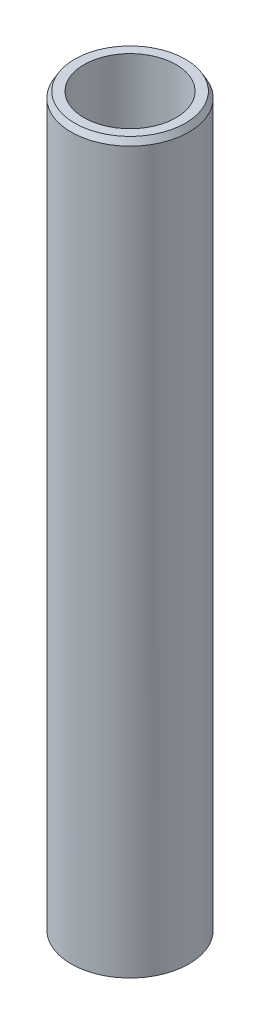
ISO-10303-21;
HEADER;
FILE_DESCRIPTION(('STEP AP214'),'2;1');
FILE_NAME('part.step','',(''),(''),'','','');
FILE_SCHEMA(('AUTOMOTIVE_DESIGN { 1 0 10303 214 1 1 1 1 }'));
ENDSEC;
DATA;
#1=APPLICATION_CONTEXT('core data for automotive mechanical design processes');
#2=APPLICATION_PROTOCOL_DEFINITION('international standard','automotive_design',2000,#1);
#3=PRODUCT_CONTEXT('',#1,'mechanical');
#4=PRODUCT('Part','Part','',(#3));
#5=PRODUCT_RELATED_PRODUCT_CATEGORY('part','',(#4));
#6=PRODUCT_DEFINITION_FORMATION('','',#4);
#7=PRODUCT_DEFINITION_CONTEXT('part definition',#1,'design');
#8=PRODUCT_DEFINITION('design','',#6,#7);
#9=PRODUCT_DEFINITION_SHAPE('','',#8);
#10=(LENGTH_UNIT() NAMED_UNIT(*) SI_UNIT(.MILLI.,.METRE.));
#11=(NAMED_UNIT(*) PLANE_ANGLE_UNIT() SI_UNIT($,.RADIAN.));
#12=(NAMED_UNIT(*) SI_UNIT($,.STERADIAN.) SOLID_ANGLE_UNIT());
#13=UNCERTAINTY_MEASURE_WITH_UNIT(LENGTH_MEASURE(1.E-05),#10,'distance_accuracy_value','');
#14=(GEOMETRIC_REPRESENTATION_CONTEXT(3) GLOBAL_UNCERTAINTY_ASSIGNED_CONTEXT((#13)) GLOBAL_UNIT_ASSIGNED_CONTEXT((#10,
#11,#12)) REPRESENTATION_CONTEXT('',''));
#15=CARTESIAN_POINT('',(0.,0.,0.));
#16=DIRECTION('',(0.,0.,1.));
#17=DIRECTION('',(1.,0.,0.));
#18=AXIS2_PLACEMENT_3D('',#15,#16,#17);
#19=CARTESIAN_POINT('',(0.,495.857883520627,0.));
#20=DIRECTION('',(0.,-1.,0.));
#21=DIRECTION('',(0.,0.,-1.));
#22=AXIS2_PLACEMENT_3D('',#19,#20,#21);
#23=CYLINDRICAL_SURFACE('',#22,40.);
#24=CARTESIAN_POINT('',(0.,491.773946002479,0.));
#25=DIRECTION('',(0.,1.,0.));
#26=DIRECTION('',(0.,0.,1.));
#27=AXIS2_PLACEMENT_3D('',#24,#25,#26);
#28=CIRCLE('',#27,40.);
#29=CARTESIAN_POINT('',(0.,491.773946002479,-40.));
#30=VERTEX_POINT('',#29);
#31=EDGE_CURVE('E50',#30,#30,#28,.F.);
#32=CARTESIAN_POINT('',(0.,2.35786242545671,0.));
#33=DIRECTION('',(0.,1.,0.));
#34=DIRECTION('',(0.,0.,1.));
#35=AXIS2_PLACEMENT_3D('',#32,#33,#34);
#36=CIRCLE('',#35,40.);
#37=CARTESIAN_POINT('',(0.,2.35786242545666,-40.));
#38=VERTEX_POINT('',#37);
#39=EDGE_CURVE('E51',#38,#38,#36,.T.);
#40=CARTESIAN_POINT('',(0.,491.773946002479,-40.));
#41=CARTESIAN_POINT('',(0.,486.675861798551,-40.));
#42=CARTESIAN_POINT('',(0.,481.577777594624,-40.));
#43=CARTESIAN_POINT('',(0.,471.381609186769,-40.));
#44=CARTESIAN_POINT('',(0.,466.283524982842,-40.));
#45=CARTESIAN_POINT('',(0.,456.087356574987,-40.));
#46=CARTESIAN_POINT('',(0.,450.98927237106,-40.));
#47=CARTESIAN_POINT('',(0.,440.793103963205,-40.));
#48=CARTESIAN_POINT('',(0.,435.695019759278,-40.));
#49=CARTESIAN_POINT('',(0.,425.498851351424,-40.));
#50=CARTESIAN_POINT('',(0.,420.400767147496,-40.));
#51=CARTESIAN_POINT('',(0.,410.204598739642,-40.));
#52=CARTESIAN_POINT('',(0.,405.106514535714,-40.));
#53=CARTESIAN_POINT('',(0.,394.91034612786,-40.));
#54=CARTESIAN_POINT('',(0.,389.812261923932,-40.));
#55=CARTESIAN_POINT('',(0.,379.616093516078,-40.));
#56=CARTESIAN_POINT('',(0.,374.51800931215,-40.));
#57=CARTESIAN_POINT('',(0.,364.321840904296,-40.));
#58=CARTESIAN_POINT('',(0.,359.223756700369,-40.));
#59=CARTESIAN_POINT('',(0.,349.027588292514,-40.));
#60=CARTESIAN_POINT('',(0.,343.929504088587,-40.));
#61=CARTESIAN_POINT('',(0.,333.733335680732,-40.));
#62=CARTESIAN_POINT('',(0.,328.635251476805,-40.));
#63=CARTESIAN_POINT('',(0.,318.43908306895,-40.));
#64=CARTESIAN_POINT('',(0.,313.340998865023,-40.));
#65=CARTESIAN_POINT('',(0.,303.144830457168,-40.));
#66=CARTESIAN_POINT('',(0.,298.046746253241,-40.));
#67=CARTESIAN_POINT('',(0.,287.850577845386,-40.));
#68=CARTESIAN_POINT('',(0.,282.752493641459,-40.));
#69=CARTESIAN_POINT('',(0.,272.556325233604,-40.));
#70=CARTESIAN_POINT('',(0.,267.458241029677,-40.));
#71=CARTESIAN_POINT('',(0.,257.262072621822,-40.));
#72=CARTESIAN_POINT('',(0.,252.163988417895,-40.));
#73=CARTESIAN_POINT('',(0.,241.96782001004,-40.));
#74=CARTESIAN_POINT('',(0.,236.869735806113,-40.));
#75=CARTESIAN_POINT('',(0.,226.673567398258,-40.));
#76=CARTESIAN_POINT('',(0.,221.575483194331,-40.));
#77=CARTESIAN_POINT('',(0.,211.379314786476,-40.));
#78=CARTESIAN_POINT('',(0.,206.281230582549,-40.));
#79=CARTESIAN_POINT('',(0.,196.085062174695,-40.));
#80=CARTESIAN_POINT('',(0.,190.986977970767,-40.));
#81=CARTESIAN_POINT('',(0.,180.790809562913,-40.));
#82=CARTESIAN_POINT('',(0.,175.692725358985,-40.));
#83=CARTESIAN_POINT('',(0.,165.496556951131,-40.));
#84=CARTESIAN_POINT('',(0.,160.398472747203,-40.));
#85=CARTESIAN_POINT('',(0.,150.202304339349,-40.));
#86=CARTESIAN_POINT('',(0.,145.104220135421,-40.));
#87=CARTESIAN_POINT('',(0.,134.908051727567,-40.));
#88=CARTESIAN_POINT('',(0.,129.80996752364,-40.));
#89=CARTESIAN_POINT('',(0.,119.613799115785,-40.));
#90=CARTESIAN_POINT('',(0.,114.515714911858,-40.));
#91=CARTESIAN_POINT('',(0.,104.319546504003,-40.));
#92=CARTESIAN_POINT('',(0.,99.2214623000756,-40.));
#93=CARTESIAN_POINT('',(0.,89.025293892221,-40.));
#94=CARTESIAN_POINT('',(0.,83.9272096882937,-40.));
#95=CARTESIAN_POINT('',(0.,73.7310412804391,-40.));
#96=CARTESIAN_POINT('',(0.,68.6329570765117,-40.));
#97=CARTESIAN_POINT('',(0.,58.4367886686571,-40.));
#98=CARTESIAN_POINT('',(0.,53.3387044647298,-40.));
#99=CARTESIAN_POINT('',(0.,43.1425360568751,-40.));
#100=CARTESIAN_POINT('',(0.,38.0444518529478,-40.));
#101=CARTESIAN_POINT('',(0.,27.8482834450932,-40.));
#102=CARTESIAN_POINT('',(0.,22.7501992411659,-40.));
#103=CARTESIAN_POINT('',(0.,12.5540308333113,-40.));
#104=CARTESIAN_POINT('',(0.,7.45594662938398,-40.));
#105=CARTESIAN_POINT('',(0.,2.35786242545666,-40.));
#106=B_SPLINE_CURVE_WITH_KNOTS('',3,(#40,#41,#42,#43,#44,#45,#46,#47,#48,#49,#50,#51,#52,#53,
#54,#55,#56,#57,#58,#59,#60,#61,#62,#63,#64,#65,#66,#67,#68,#69,#70,#71,#72,#73,#74,#75,#76,#77,
#78,#79,#80,#81,#82,#83,#84,#85,#86,#87,#88,#89,#90,#91,#92,#93,#94,#95,#96,#97,#98,#99,#100,
#101,#102,#103,#104,#105),.UNSPECIFIED.,.F.,.F.,(4,2,2,2,2,2,2,2,2,2,2,2,2,2,2,2,2,2,2,2,2,2,2,
2,2,2,2,2,2,2,2,2,4),(0.,15.294252611782,30.5885052235639,45.8827578353458,61.1770104471278,
76.4712630589097,91.7655156706916,107.059768282474,122.354020894256,137.648273506037,
152.942526117819,168.236778729601,183.531031341383,198.825283953165,214.119536564947,
229.413789176729,244.708041788511,260.002294400293,275.296547012075,290.590799623857,
305.885052235639,321.179304847421,336.473557459203,351.767810070985,367.062062682766,
382.356315294548,397.65056790633,412.944820518112,428.239073129894,443.533325741676,
458.827578353458,474.12183096524,489.416083577022),.UNSPECIFIED.);
#107=EDGE_CURVE('BSEAM39',#30,#38,#106,.T.);
#108=ORIENTED_EDGE('',*,*,#31,.T.);
#109=ORIENTED_EDGE('',*,*,#39,.T.);
#110=ORIENTED_EDGE('',*,*,#107,.T.);
#111=ORIENTED_EDGE('',*,*,#107,.F.);
#112=EDGE_LOOP('',(#108,#110,#109,#111));
#113=FACE_BOUND('',#112,.T.);
#114=ADVANCED_FACE('F39',(#113),#23,.T.);
#115=CARTESIAN_POINT('',(0.,495.857883520627,0.));
#116=DIRECTION('',(0.,1.,0.));
#117=DIRECTION('',(0.,0.,1.));
#118=AXIS2_PLACEMENT_3D('',#115,#116,#117);
#119=PLANE('',#118);
#120=CARTESIAN_POINT('',(0.,495.857883520627,0.));
#121=DIRECTION('',(0.,1.,0.));
#122=DIRECTION('',(0.,0.,1.));
#123=AXIS2_PLACEMENT_3D('',#120,#121,#122);
#124=CIRCLE('',#123,37.6421375745438);
#125=CARTESIAN_POINT('',(0.,495.857883520627,37.6421375745438));
#126=VERTEX_POINT('',#125);
#127=EDGE_CURVE('E54',#126,#126,#124,.T.);
#128=ORIENTED_EDGE('',*,*,#127,.T.);
#129=EDGE_LOOP('',(#128));
#130=FACE_BOUND('',#129,.T.);
#131=CARTESIAN_POINT('',(0.,495.857883520627,0.));
#132=DIRECTION('',(0.,1.,0.));
#133=DIRECTION('',(0.,0.,1.));
#134=AXIS2_PLACEMENT_3D('',#131,#132,#133);
#135=CIRCLE('',#134,31.2653921572094);
#136=CARTESIAN_POINT('',(0.,495.857883520627,-31.2653921572094));
#137=VERTEX_POINT('',#136);
#138=EDGE_CURVE('E58',#137,#137,#135,.T.);
#139=ORIENTED_EDGE('',*,*,#138,.F.);
#140=EDGE_LOOP('',(#139));
#141=FACE_BOUND('',#140,.T.);
#142=ADVANCED_FACE('F69',(#130,#141),#119,.T.);
#143=CARTESIAN_POINT('',(0.,0.,0.));
#144=DIRECTION('',(0.,1.,0.));
#145=DIRECTION('',(0.,0.,1.));
#146=AXIS2_PLACEMENT_3D('',#143,#144,#145);
#147=PLANE('',#146);
#148=CARTESIAN_POINT('',(0.,0.,0.));
#149=DIRECTION('',(0.,1.,0.));
#150=DIRECTION('',(0.,0.,1.));
#151=AXIS2_PLACEMENT_3D('',#148,#149,#150);
#152=CIRCLE('',#151,35.9160624818514);
#153=CARTESIAN_POINT('',(0.,0.,35.9160624818514));
#154=VERTEX_POINT('',#153);
#155=EDGE_CURVE('E10',#154,#154,#152,.F.);
#156=ORIENTED_EDGE('',*,*,#155,.T.);
#157=EDGE_LOOP('',(#156));
#158=FACE_BOUND('',#157,.T.);
#159=CARTESIAN_POINT('',(0.,0.,0.));
#160=DIRECTION('',(0.,1.,0.));
#161=DIRECTION('',(0.,0.,1.));
#162=AXIS2_PLACEMENT_3D('',#159,#160,#161);
#163=CIRCLE('',#162,31.2653921572094);
#164=CARTESIAN_POINT('',(0.,0.,-31.2653921572094));
#165=VERTEX_POINT('',#164);
#166=EDGE_CURVE('E63',#165,#165,#163,.T.);
#167=ORIENTED_EDGE('',*,*,#166,.T.);
#168=EDGE_LOOP('',(#167));
#169=FACE_BOUND('',#168,.T.);
#170=ADVANCED_FACE('F75',(#158,#169),#147,.F.);
#171=CARTESIAN_POINT('',(0.,495.857883520627,0.));
#172=DIRECTION('',(0.,-1.,0.));
#173=DIRECTION('',(0.,0.,-1.));
#174=AXIS2_PLACEMENT_3D('',#171,#172,#173);
#175=CYLINDRICAL_SURFACE('',#174,31.2653921572094);
#176=CARTESIAN_POINT('',(0.,495.857883520627,-31.2653921572094));
#177=CARTESIAN_POINT('',(0.,490.692697233953,-31.2653921572094));
#178=CARTESIAN_POINT('',(0.,485.52751094728,-31.2653921572094));
#179=CARTESIAN_POINT('',(0.,475.197138373934,-31.2653921572094));
#180=CARTESIAN_POINT('',(0.,470.03195208726,-31.2653921572094));
#181=CARTESIAN_POINT('',(0.,459.701579513914,-31.2653921572094));
#182=CARTESIAN_POINT('',(0.,454.536393227241,-31.2653921572094));
#183=CARTESIAN_POINT('',(0.,444.206020653895,-31.2653921572094));
#184=CARTESIAN_POINT('',(0.,439.040834367221,-31.2653921572094));
#185=CARTESIAN_POINT('',(0.,428.710461793875,-31.2653921572094));
#186=CARTESIAN_POINT('',(0.,423.545275507202,-31.2653921572094));
#187=CARTESIAN_POINT('',(0.,413.214902933855,-31.2653921572094));
#188=CARTESIAN_POINT('',(0.,408.049716647182,-31.2653921572094));
#189=CARTESIAN_POINT('',(0.,397.719344073836,-31.2653921572094));
#190=CARTESIAN_POINT('',(0.,392.554157787163,-31.2653921572094));
#191=CARTESIAN_POINT('',(0.,382.223785213816,-31.2653921572094));
#192=CARTESIAN_POINT('',(0.,377.058598927143,-31.2653921572094));
#193=CARTESIAN_POINT('',(0.,366.728226353797,-31.2653921572094));
#194=CARTESIAN_POINT('',(0.,361.563040067123,-31.2653921572094));
#195=CARTESIAN_POINT('',(0.,351.232667493777,-31.2653921572094));
#196=CARTESIAN_POINT('',(0.,346.067481207104,-31.2653921572094));
#197=CARTESIAN_POINT('',(0.,335.737108633757,-31.2653921572094));
#198=CARTESIAN_POINT('',(0.,330.571922347084,-31.2653921572094));
#199=CARTESIAN_POINT('',(0.,320.241549773738,-31.2653921572094));
#200=CARTESIAN_POINT('',(0.,315.076363487065,-31.2653921572094));
#201=CARTESIAN_POINT('',(0.,304.745990913718,-31.2653921572094));
#202=CARTESIAN_POINT('',(0.,299.580804627045,-31.2653921572094));
#203=CARTESIAN_POINT('',(0.,289.250432053699,-31.2653921572094));
#204=CARTESIAN_POINT('',(0.,284.085245767026,-31.2653921572094));
#205=CARTESIAN_POINT('',(0.,273.754873193679,-31.2653921572094));
#206=CARTESIAN_POINT('',(0.,268.589686907006,-31.2653921572094));
#207=CARTESIAN_POINT('',(0.,258.25931433366,-31.2653921572094));
#208=CARTESIAN_POINT('',(0.,253.094128046986,-31.2653921572094));
#209=CARTESIAN_POINT('',(0.,242.76375547364,-31.2653921572094));
#210=CARTESIAN_POINT('',(0.,237.598569186967,-31.2653921572094));
#211=CARTESIAN_POINT('',(0.,227.26819661362,-31.2653921572094));
#212=CARTESIAN_POINT('',(0.,222.103010326947,-31.2653921572094));
#213=CARTESIAN_POINT('',(0.,211.772637753601,-31.2653921572094));
#214=CARTESIAN_POINT('',(0.,206.607451466928,-31.2653921572094));
#215=CARTESIAN_POINT('',(0.,196.277078893581,-31.2653921572094));
#216=CARTESIAN_POINT('',(0.,191.111892606908,-31.2653921572094));
#217=CARTESIAN_POINT('',(0.,180.781520033562,-31.2653921572094));
#218=CARTESIAN_POINT('',(0.,175.616333746889,-31.2653921572094));
#219=CARTESIAN_POINT('',(0.,165.285961173542,-31.2653921572094));
#220=CARTESIAN_POINT('',(0.,160.120774886869,-31.2653921572094));
#221=CARTESIAN_POINT('',(0.,149.790402313523,-31.2653921572094));
#222=CARTESIAN_POINT('',(0.,144.625216026849,-31.2653921572094));
#223=CARTESIAN_POINT('',(0.,134.294843453503,-31.2653921572094));
#224=CARTESIAN_POINT('',(0.,129.12965716683,-31.2653921572094));
#225=CARTESIAN_POINT('',(0.,118.799284593483,-31.2653921572094));
#226=CARTESIAN_POINT('',(0.,113.63409830681,-31.2653921572094));
#227=CARTESIAN_POINT('',(0.,103.303725733464,-31.2653921572094));
#228=CARTESIAN_POINT('',(0.,98.1385394467906,-31.2653921572094));
#229=CARTESIAN_POINT('',(0.,87.8081668734443,-31.2653921572094));
#230=CARTESIAN_POINT('',(0.,82.6429805867711,-31.2653921572094));
#231=CARTESIAN_POINT('',(0.,72.3126080134247,-31.2653921572094));
#232=CARTESIAN_POINT('',(0.,67.1474217267515,-31.2653921572094));
#233=CARTESIAN_POINT('',(0.,56.8170491534051,-31.2653921572094));
#234=CARTESIAN_POINT('',(0.,51.6518628667319,-31.2653921572094));
#235=CARTESIAN_POINT('',(0.,41.3214902933855,-31.2653921572094));
#236=CARTESIAN_POINT('',(0.,36.1563040067123,-31.2653921572094));
#237=CARTESIAN_POINT('',(0.,25.825931433366,-31.2653921572094));
#238=CARTESIAN_POINT('',(0.,20.6607451466928,-31.2653921572094));
#239=CARTESIAN_POINT('',(0.,10.3303725733464,-31.2653921572094));
#240=CARTESIAN_POINT('',(0.,5.16518628667319,-31.2653921572094));
#241=CARTESIAN_POINT('',(0.,0.,-31.2653921572094));
#242=B_SPLINE_CURVE_WITH_KNOTS('',3,(#176,#177,#178,#179,#180,#181,#182,#183,#184,#185,#186,
#187,#188,#189,#190,#191,#192,#193,#194,#195,#196,#197,#198,#199,#200,#201,#202,#203,#204,#205,
#206,#207,#208,#209,#210,#211,#212,#213,#214,#215,#216,#217,#218,#219,#220,#221,#222,#223,#224,
#225,#226,#227,#228,#229,#230,#231,#232,#233,#234,#235,#236,#237,#238,#239,#240,#241),
.UNSPECIFIED.,.F.,.F.,(4,2,2,2,2,2,2,2,2,2,2,2,2,2,2,2,2,2,2,2,2,2,2,2,2,2,2,2,2,2,2,2,4),(0.,
15.4955588600196,30.9911177200392,46.4866765800588,61.9822354400784,77.4777943000979,
92.9733531601175,108.468912020137,123.964470880157,139.460029740176,154.955588600196,
170.451147460215,185.946706320235,201.442265180255,216.937824040274,232.433382900294,
247.928941760313,263.424500620333,278.920059480352,294.415618340372,309.911177200392,
325.406736060411,340.902294920431,356.39785378045,371.89341264047,387.388971500489,
402.884530360509,418.380089220529,433.875648080548,449.371206940568,464.866765800587,
480.362324660607,495.857883520627),.UNSPECIFIED.);
#243=EDGE_CURVE('BSEAM70',#137,#165,#242,.T.);
#244=ORIENTED_EDGE('',*,*,#138,.T.);
#245=ORIENTED_EDGE('',*,*,#166,.F.);
#246=ORIENTED_EDGE('',*,*,#243,.T.);
#247=ORIENTED_EDGE('',*,*,#243,.F.);
#248=EDGE_LOOP('',(#244,#246,#245,#247));
#249=FACE_BOUND('',#248,.T.);
#250=ADVANCED_FACE('F70',(#249),#175,.F.);
#251=CARTESIAN_POINT('',(0.,495.857883520627,0.));
#252=DIRECTION('',(0.,-1.,0.));
#253=DIRECTION('',(0.,0.,-1.));
#254=AXIS2_PLACEMENT_3D('',#251,#252,#253);
#255=CONICAL_SURFACE('',#254,37.6421375745438,0.523598775598293);
#256=ORIENTED_EDGE('',*,*,#31,.F.);
#257=EDGE_LOOP('',(#256));
#258=FACE_BOUND('',#257,.T.);
#259=ORIENTED_EDGE('',*,*,#127,.F.);
#260=EDGE_LOOP('',(#259));
#261=FACE_BOUND('',#260,.T.);
#262=ADVANCED_FACE('F81',(#258,#261),#255,.T.);
#263=CARTESIAN_POINT('',(0.,2.35786242545671,0.));
#264=DIRECTION('',(0.,1.,0.));
#265=DIRECTION('',(0.,0.,1.));
#266=AXIS2_PLACEMENT_3D('',#263,#264,#265);
#267=CONICAL_SURFACE('',#266,40.,1.04719755119659);
#268=ORIENTED_EDGE('',*,*,#155,.F.);
#269=EDGE_LOOP('',(#268));
#270=FACE_BOUND('',#269,.T.);
#271=ORIENTED_EDGE('',*,*,#39,.F.);
#272=EDGE_LOOP('',(#271));
#273=FACE_BOUND('',#272,.T.);
#274=ADVANCED_FACE('F45',(#270,#273),#267,.T.);
#275=CLOSED_SHELL('',(#114,#142,#170,#250,#262,#274));
#276=MANIFOLD_SOLID_BREP('B2',#275);
#277=ADVANCED_BREP_SHAPE_REPRESENTATION('',(#18,#276),#14);
#278=SHAPE_DEFINITION_REPRESENTATION(#9,#277);
ENDSEC;
END-ISO-10303-21;
